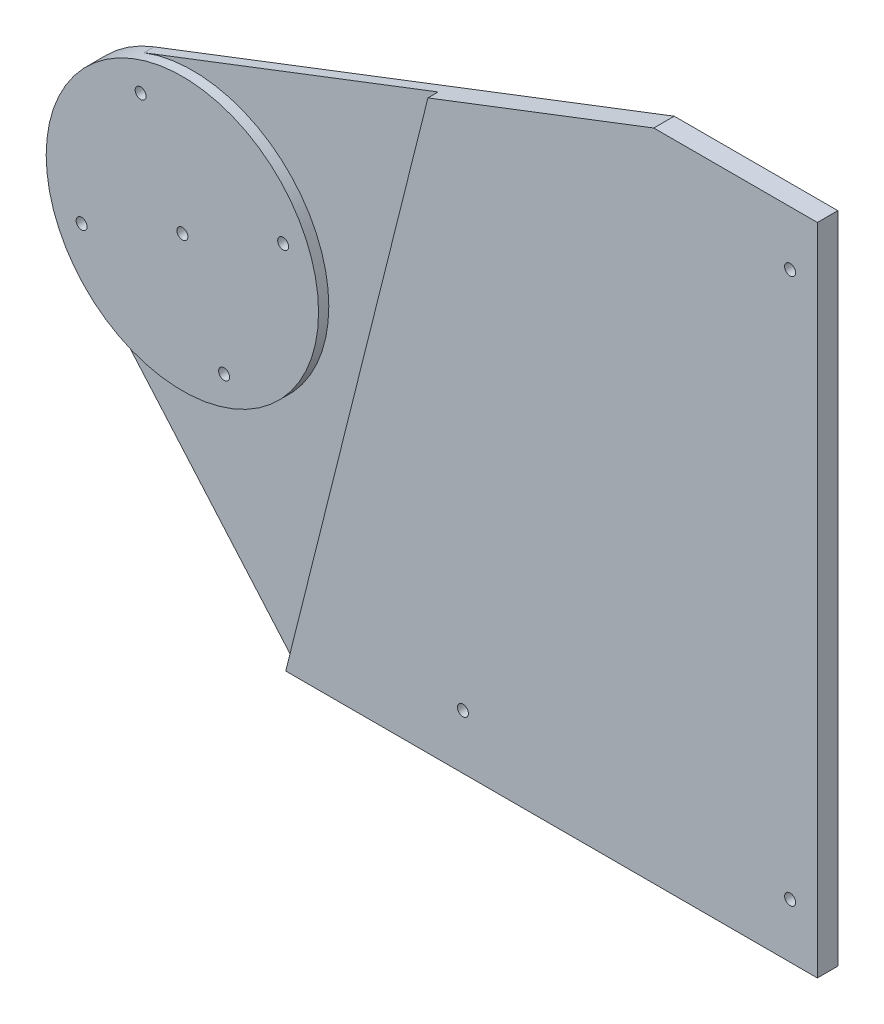
ISO-10303-21;
HEADER;
FILE_DESCRIPTION(('STEP AP214'),'2;1');
FILE_NAME('part.step','',(''),(''),'','','');
FILE_SCHEMA(('AUTOMOTIVE_DESIGN { 1 0 10303 214 1 1 1 1 }'));
ENDSEC;
DATA;
#1=APPLICATION_CONTEXT('core data for automotive mechanical design processes');
#2=APPLICATION_PROTOCOL_DEFINITION('international standard','automotive_design',2000,#1);
#3=PRODUCT_CONTEXT('',#1,'mechanical');
#4=PRODUCT('Part','Part','',(#3));
#5=PRODUCT_RELATED_PRODUCT_CATEGORY('part','',(#4));
#6=PRODUCT_DEFINITION_FORMATION('','',#4);
#7=PRODUCT_DEFINITION_CONTEXT('part definition',#1,'design');
#8=PRODUCT_DEFINITION('design','',#6,#7);
#9=PRODUCT_DEFINITION_SHAPE('','',#8);
#10=(LENGTH_UNIT() NAMED_UNIT(*) SI_UNIT(.MILLI.,.METRE.));
#11=(NAMED_UNIT(*) PLANE_ANGLE_UNIT() SI_UNIT($,.RADIAN.));
#12=(NAMED_UNIT(*) SI_UNIT($,.STERADIAN.) SOLID_ANGLE_UNIT());
#13=UNCERTAINTY_MEASURE_WITH_UNIT(LENGTH_MEASURE(1.E-05),#10,'distance_accuracy_value','');
#14=(GEOMETRIC_REPRESENTATION_CONTEXT(3) GLOBAL_UNCERTAINTY_ASSIGNED_CONTEXT((#13)) GLOBAL_UNIT_ASSIGNED_CONTEXT((#10,
#11,#12)) REPRESENTATION_CONTEXT('',''));
#15=CARTESIAN_POINT('',(0.,0.,0.));
#16=DIRECTION('',(0.,0.,1.));
#17=DIRECTION('',(1.,0.,0.));
#18=AXIS2_PLACEMENT_3D('',#15,#16,#17);
#19=CARTESIAN_POINT('',(-47.9375603293225,-41.5473205143554,-9.525));
#20=DIRECTION('',(0.755677887798388,0.654943455492585,0.));
#21=DIRECTION('',(-0.654943455492585,0.755677887798388,0.));
#22=AXIS2_PLACEMENT_3D('',#19,#20,#21);
#23=PLANE('',#22);
#24=DIRECTION('',(-0.654943455492585,0.755677887798388,0.));
#25=VECTOR('',#24,1.);
#26=CARTESIAN_POINT('',(-47.9375603293225,-41.5473205143554,-4.7752));
#27=LINE('',#26,#25);
#28=CARTESIAN_POINT('',(48.1380800000001,-152.4,-4.7752));
#29=VERTEX_POINT('',#28);
#30=CARTESIAN_POINT('',(-47.9375603293225,-41.5473205143554,-4.7752));
#31=VERTEX_POINT('',#30);
#32=EDGE_CURVE('E200',#29,#31,#27,.T.);
#33=ORIENTED_EDGE('',*,*,#32,.T.);
#34=DIRECTION('',(0.,0.,1.));
#35=VECTOR('',#34,1.);
#36=CARTESIAN_POINT('',(-47.9375603293224,-41.5473205143553,-9.525));
#37=LINE('',#36,#35);
#38=CARTESIAN_POINT('',(-47.9375603293224,-41.5473205143553,-9.525));
#39=VERTEX_POINT('',#38);
#40=EDGE_CURVE('E140',#39,#31,#37,.T.);
#41=ORIENTED_EDGE('',*,*,#40,.F.);
#42=DIRECTION('',(-0.654943455492585,0.755677887798388,0.));
#43=VECTOR('',#42,1.);
#44=CARTESIAN_POINT('',(-47.9375603293225,-41.5473205143554,-9.525));
#45=LINE('',#44,#43);
#46=CARTESIAN_POINT('',(48.1380800000001,-152.4,-9.525));
#47=VERTEX_POINT('',#46);
#48=EDGE_CURVE('E122',#47,#39,#45,.T.);
#49=ORIENTED_EDGE('',*,*,#48,.F.);
#50=DIRECTION('',(0.,0.,1.));
#51=VECTOR('',#50,1.);
#52=CARTESIAN_POINT('',(48.1380800000001,-152.4,-9.525));
#53=LINE('',#52,#51);
#54=EDGE_CURVE('E116',#47,#29,#53,.T.);
#55=ORIENTED_EDGE('',*,*,#54,.T.);
#56=EDGE_LOOP('',(#33,#41,#49,#55));
#57=FACE_BOUND('',#56,.T.);
#58=ADVANCED_FACE('F39',(#57),#23,.F.);
#59=CARTESIAN_POINT('',(0.,0.,0.));
#60=DIRECTION('',(0.,0.,1.));
#61=DIRECTION('',(1.,0.,0.));
#62=AXIS2_PLACEMENT_3D('',#59,#60,#61);
#63=PLANE('',#62);
#64=CARTESIAN_POINT('',(46.9330802515733,19.4403183641468,0.));
#65=DIRECTION('',(0.,0.,1.));
#66=DIRECTION('',(1.,0.,0.));
#67=AXIS2_PLACEMENT_3D('',#64,#65,#66);
#68=CIRCLE('',#67,2.55269999999999);
#69=CARTESIAN_POINT('',(49.4857802515733,19.4403183641468,0.));
#70=VERTEX_POINT('',#69);
#71=EDGE_CURVE('E243',#70,#70,#68,.T.);
#72=ORIENTED_EDGE('',*,*,#71,.F.);
#73=EDGE_LOOP('',(#72));
#74=FACE_BOUND('',#73,.T.);
#75=CARTESIAN_POINT('',(19.4403183641484,-46.9330802515721,0.));
#76=DIRECTION('',(0.,0.,1.));
#77=DIRECTION('',(1.,0.,0.));
#78=AXIS2_PLACEMENT_3D('',#75,#76,#77);
#79=CIRCLE('',#78,2.55269999999999);
#80=CARTESIAN_POINT('',(21.9930183641484,-46.9330802515721,0.));
#81=VERTEX_POINT('',#80);
#82=EDGE_CURVE('E254',#81,#81,#79,.T.);
#83=ORIENTED_EDGE('',*,*,#82,.F.);
#84=EDGE_LOOP('',(#83));
#85=FACE_BOUND('',#84,.T.);
#86=CARTESIAN_POINT('',(-46.9330802515704,-19.4403183641473,0.));
#87=DIRECTION('',(0.,0.,1.));
#88=DIRECTION('',(1.,0.,0.));
#89=AXIS2_PLACEMENT_3D('',#86,#87,#88);
#90=CIRCLE('',#89,2.55269999999998);
#91=CARTESIAN_POINT('',(-44.3803802515704,-19.4403183641473,0.));
#92=VERTEX_POINT('',#91);
#93=EDGE_CURVE('E260',#92,#92,#90,.T.);
#94=ORIENTED_EDGE('',*,*,#93,.F.);
#95=EDGE_LOOP('',(#94));
#96=FACE_BOUND('',#95,.T.);
#97=CARTESIAN_POINT('',(-19.4403183641456,46.9330802515716,0.));
#98=DIRECTION('',(0.,0.,1.));
#99=DIRECTION('',(1.,0.,0.));
#100=AXIS2_PLACEMENT_3D('',#97,#98,#99);
#101=CIRCLE('',#100,2.55269999999999);
#102=CARTESIAN_POINT('',(-16.8876183641456,46.9330802515716,0.));
#103=VERTEX_POINT('',#102);
#104=EDGE_CURVE('E266',#103,#103,#101,.T.);
#105=ORIENTED_EDGE('',*,*,#104,.F.);
#106=EDGE_LOOP('',(#105));
#107=FACE_BOUND('',#106,.T.);
#108=CARTESIAN_POINT('',(1.42594269725294E-12,-2.4980018054066E-13,0.));
#109=DIRECTION('',(0.,0.,1.));
#110=DIRECTION('',(1.,0.,0.));
#111=AXIS2_PLACEMENT_3D('',#108,#109,#110);
#112=CIRCLE('',#111,2.55269999999856);
#113=CARTESIAN_POINT('',(2.55269999999999,-2.4980018054066E-13,0.));
#114=VERTEX_POINT('',#113);
#115=EDGE_CURVE('E271',#114,#114,#112,.T.);
#116=ORIENTED_EDGE('',*,*,#115,.F.);
#117=EDGE_LOOP('',(#116));
#118=FACE_BOUND('',#117,.T.);
#119=CARTESIAN_POINT('',(0.,0.,0.));
#120=DIRECTION('',(0.,0.,1.));
#121=DIRECTION('',(1.,0.,0.));
#122=AXIS2_PLACEMENT_3D('',#119,#120,#121);
#123=CIRCLE('',#122,63.4365);
#124=CARTESIAN_POINT('',(63.4365,0.,0.));
#125=VERTEX_POINT('',#124);
#126=EDGE_CURVE('E130',#125,#125,#123,.T.);
#127=ORIENTED_EDGE('',*,*,#126,.T.);
#128=EDGE_LOOP('',(#127));
#129=FACE_BOUND('',#128,.T.);
#130=ADVANCED_FACE('F180',(#74,#85,#96,#107,#118,#129),#63,.T.);
#131=CARTESIAN_POINT('',(-22.7673240831609,59.2101214856237,-9.525));
#132=DIRECTION('',(0.35889943617887,-0.933376234275594,0.));
#133=DIRECTION('',(0.933376234275594,0.35889943617887,0.));
#134=AXIS2_PLACEMENT_3D('',#131,#132,#133);
#135=PLANE('',#134);
#136=DIRECTION('',(0.933376234275594,0.35889943617887,0.));
#137=VECTOR('',#136,1.);
#138=CARTESIAN_POINT('',(-22.7673240831609,59.2101214856237,-4.7752));
#139=LINE('',#138,#137);
#140=CARTESIAN_POINT('',(-22.7673240831609,59.2101214856237,-4.7752));
#141=VERTEX_POINT('',#140);
#142=CARTESIAN_POINT('',(114.391061614432,111.949912243501,-4.7752));
#143=VERTEX_POINT('',#142);
#144=EDGE_CURVE('E147',#141,#143,#139,.T.);
#145=ORIENTED_EDGE('',*,*,#144,.T.);
#146=DIRECTION('',(0.,0.,1.));
#147=VECTOR('',#146,1.);
#148=CARTESIAN_POINT('',(114.391061614432,111.949912243501,-4.7752));
#149=LINE('',#148,#147);
#150=CARTESIAN_POINT('',(114.391061614432,111.949912243501,0.));
#151=VERTEX_POINT('',#150);
#152=EDGE_CURVE('E131',#143,#151,#149,.T.);
#153=ORIENTED_EDGE('',*,*,#152,.T.);
#154=DIRECTION('',(0.933376234275594,0.35889943617887,0.));
#155=VECTOR('',#154,1.);
#156=CARTESIAN_POINT('',(-22.7673240831609,59.2101214856237,0.));
#157=LINE('',#156,#155);
#158=CARTESIAN_POINT('',(219.58808,152.4,0.));
#159=VERTEX_POINT('',#158);
#160=EDGE_CURVE('E80',#151,#159,#157,.T.);
#161=ORIENTED_EDGE('',*,*,#160,.T.);
#162=DIRECTION('',(0.,0.,1.));
#163=VECTOR('',#162,1.);
#164=CARTESIAN_POINT('',(219.58808,152.4,-9.525));
#165=LINE('',#164,#163);
#166=CARTESIAN_POINT('',(219.58808,152.4,-9.525));
#167=VERTEX_POINT('',#166);
#168=EDGE_CURVE('E11',#167,#159,#165,.T.);
#169=ORIENTED_EDGE('',*,*,#168,.F.);
#170=DIRECTION('',(0.933376234275594,0.35889943617887,0.));
#171=VECTOR('',#170,1.);
#172=CARTESIAN_POINT('',(-22.7673240831609,59.2101214856237,-9.525));
#173=LINE('',#172,#171);
#174=CARTESIAN_POINT('',(-22.7673240831609,59.2101214856237,-9.525));
#175=VERTEX_POINT('',#174);
#176=EDGE_CURVE('E137',#175,#167,#173,.T.);
#177=ORIENTED_EDGE('',*,*,#176,.F.);
#178=DIRECTION('',(0.,0.,1.));
#179=VECTOR('',#178,1.);
#180=CARTESIAN_POINT('',(-22.7673240831609,59.2101214856237,-9.525));
#181=LINE('',#180,#179);
#182=EDGE_CURVE('E43',#175,#141,#181,.T.);
#183=ORIENTED_EDGE('',*,*,#182,.T.);
#184=EDGE_LOOP('',(#145,#153,#161,#169,#177,#183));
#185=FACE_BOUND('',#184,.T.);
#186=ADVANCED_FACE('F41',(#185),#135,.F.);
#187=CARTESIAN_POINT('',(0.,152.4,-9.525));
#188=DIRECTION('',(0.,-1.,0.));
#189=DIRECTION('',(1.,0.,0.));
#190=AXIS2_PLACEMENT_3D('',#187,#188,#189);
#191=PLANE('',#190);
#192=DIRECTION('',(1.,0.,0.));
#193=VECTOR('',#192,1.);
#194=CARTESIAN_POINT('',(0.,152.4,0.));
#195=LINE('',#194,#193);
#196=CARTESIAN_POINT('',(295.78808,152.4,0.));
#197=VERTEX_POINT('',#196);
#198=EDGE_CURVE('E72',#159,#197,#195,.T.);
#199=ORIENTED_EDGE('',*,*,#198,.T.);
#200=DIRECTION('',(0.,0.,1.));
#201=VECTOR('',#200,1.);
#202=CARTESIAN_POINT('',(295.78808,152.4,-9.525));
#203=LINE('',#202,#201);
#204=CARTESIAN_POINT('',(295.78808,152.4,-9.525));
#205=VERTEX_POINT('',#204);
#206=EDGE_CURVE('E49',#205,#197,#203,.T.);
#207=ORIENTED_EDGE('',*,*,#206,.F.);
#208=DIRECTION('',(1.,0.,0.));
#209=VECTOR('',#208,1.);
#210=CARTESIAN_POINT('',(0.,152.4,-9.525));
#211=LINE('',#210,#209);
#212=EDGE_CURVE('E57',#167,#205,#211,.T.);
#213=ORIENTED_EDGE('',*,*,#212,.F.);
#214=ORIENTED_EDGE('',*,*,#168,.T.);
#215=EDGE_LOOP('',(#199,#207,#213,#214));
#216=FACE_BOUND('',#215,.T.);
#217=ADVANCED_FACE('F172',(#216),#191,.F.);
#218=CARTESIAN_POINT('',(295.78808,1.07739743053041E-13,-9.525));
#219=DIRECTION('',(-1.,0.,0.));
#220=DIRECTION('',(0.,-1.,0.));
#221=AXIS2_PLACEMENT_3D('',#218,#219,#220);
#222=PLANE('',#221);
#223=DIRECTION('',(0.,-1.,0.));
#224=VECTOR('',#223,1.);
#225=CARTESIAN_POINT('',(295.78808,1.07739743053041E-13,0.));
#226=LINE('',#225,#224);
#227=CARTESIAN_POINT('',(295.78808,-152.4,0.));
#228=VERTEX_POINT('',#227);
#229=EDGE_CURVE('E112',#197,#228,#226,.T.);
#230=ORIENTED_EDGE('',*,*,#229,.T.);
#231=DIRECTION('',(0.,0.,1.));
#232=VECTOR('',#231,1.);
#233=CARTESIAN_POINT('',(295.78808,-152.4,-9.525));
#234=LINE('',#233,#232);
#235=CARTESIAN_POINT('',(295.78808,-152.4,-9.525));
#236=VERTEX_POINT('',#235);
#237=EDGE_CURVE('E109',#236,#228,#234,.T.);
#238=ORIENTED_EDGE('',*,*,#237,.F.);
#239=DIRECTION('',(0.,-1.,0.));
#240=VECTOR('',#239,1.);
#241=CARTESIAN_POINT('',(295.78808,1.07739743053041E-13,-9.525));
#242=LINE('',#241,#240);
#243=EDGE_CURVE('E100',#205,#236,#242,.T.);
#244=ORIENTED_EDGE('',*,*,#243,.F.);
#245=ORIENTED_EDGE('',*,*,#206,.T.);
#246=EDGE_LOOP('',(#230,#238,#244,#245));
#247=FACE_BOUND('',#246,.T.);
#248=ADVANCED_FACE('F110',(#247),#222,.F.);
#249=CARTESIAN_POINT('',(0.,-152.4,-9.525));
#250=DIRECTION('',(0.,1.,0.));
#251=DIRECTION('',(-1.,0.,0.));
#252=AXIS2_PLACEMENT_3D('',#249,#250,#251);
#253=PLANE('',#252);
#254=DIRECTION('',(-1.,0.,0.));
#255=VECTOR('',#254,1.);
#256=CARTESIAN_POINT('',(0.,-152.4,0.));
#257=LINE('',#256,#255);
#258=CARTESIAN_POINT('',(48.1380800000001,-152.4,0.));
#259=VERTEX_POINT('',#258);
#260=EDGE_CURVE('E134',#228,#259,#257,.T.);
#261=ORIENTED_EDGE('',*,*,#260,.T.);
#262=DIRECTION('',(0.,0.,1.));
#263=VECTOR('',#262,1.);
#264=CARTESIAN_POINT('',(48.1380800000001,-152.4,-4.7752));
#265=LINE('',#264,#263);
#266=EDGE_CURVE('E166',#29,#259,#265,.T.);
#267=ORIENTED_EDGE('',*,*,#266,.F.);
#268=ORIENTED_EDGE('',*,*,#54,.F.);
#269=DIRECTION('',(-1.,0.,0.));
#270=VECTOR('',#269,1.);
#271=CARTESIAN_POINT('',(0.,-152.4,-9.525));
#272=LINE('',#271,#270);
#273=EDGE_CURVE('E104',#236,#47,#272,.T.);
#274=ORIENTED_EDGE('',*,*,#273,.F.);
#275=ORIENTED_EDGE('',*,*,#237,.T.);
#276=EDGE_LOOP('',(#261,#267,#268,#274,#275));
#277=FACE_BOUND('',#276,.T.);
#278=ADVANCED_FACE('F118',(#277),#253,.F.);
#279=CARTESIAN_POINT('',(0.,0.,-9.525));
#280=DIRECTION('',(0.,0.,1.));
#281=DIRECTION('',(1.,0.,0.));
#282=AXIS2_PLACEMENT_3D('',#279,#280,#281);
#283=CYLINDRICAL_SURFACE('',#282,63.4365);
#284=ORIENTED_EDGE('',*,*,#126,.F.);
#285=EDGE_LOOP('',(#284));
#286=FACE_BOUND('',#285,.T.);
#287=CARTESIAN_POINT('',(0.,0.,-4.7752));
#288=DIRECTION('',(0.,0.,1.));
#289=DIRECTION('',(1.,0.,0.));
#290=AXIS2_PLACEMENT_3D('',#287,#288,#289);
#291=CIRCLE('',#290,63.4365);
#292=EDGE_CURVE('E158',#31,#141,#291,.T.);
#293=ORIENTED_EDGE('',*,*,#292,.T.);
#294=ORIENTED_EDGE('',*,*,#182,.F.);
#295=CARTESIAN_POINT('',(0.,0.,-9.525));
#296=DIRECTION('',(0.,0.,1.));
#297=DIRECTION('',(1.,0.,0.));
#298=AXIS2_PLACEMENT_3D('',#295,#296,#297);
#299=CIRCLE('',#298,63.4365);
#300=EDGE_CURVE('E124',#175,#39,#299,.T.);
#301=ORIENTED_EDGE('',*,*,#300,.T.);
#302=ORIENTED_EDGE('',*,*,#40,.T.);
#303=EDGE_LOOP('',(#293,#294,#301,#302));
#304=FACE_BOUND('',#303,.T.);
#305=ADVANCED_FACE('F190',(#286,#304),#283,.T.);
#306=CARTESIAN_POINT('',(0.,0.,-9.525));
#307=DIRECTION('',(0.,0.,1.));
#308=DIRECTION('',(1.,0.,0.));
#309=AXIS2_PLACEMENT_3D('',#306,#307,#308);
#310=PLANE('',#309);
#311=CARTESIAN_POINT('',(283.08808,127.,-9.525));
#312=DIRECTION('',(0.,0.,1.));
#313=DIRECTION('',(1.,0.,0.));
#314=AXIS2_PLACEMENT_3D('',#311,#312,#313);
#315=CIRCLE('',#314,2.55270000000002);
#316=CARTESIAN_POINT('',(285.64078,127.,-9.525));
#317=VERTEX_POINT('',#316);
#318=EDGE_CURVE('E318',#317,#317,#315,.T.);
#319=ORIENTED_EDGE('',*,*,#318,.T.);
#320=EDGE_LOOP('',(#319));
#321=FACE_BOUND('',#320,.T.);
#322=CARTESIAN_POINT('',(283.08808,-127.,-9.525));
#323=DIRECTION('',(0.,0.,1.));
#324=DIRECTION('',(1.,0.,0.));
#325=AXIS2_PLACEMENT_3D('',#322,#323,#324);
#326=CIRCLE('',#325,2.55270000000002);
#327=CARTESIAN_POINT('',(285.64078,-127.,-9.525));
#328=VERTEX_POINT('',#327);
#329=EDGE_CURVE('E240',#328,#328,#326,.T.);
#330=ORIENTED_EDGE('',*,*,#329,.T.);
#331=EDGE_LOOP('',(#330));
#332=FACE_BOUND('',#331,.T.);
#333=CARTESIAN_POINT('',(130.68808,-127.,-9.525));
#334=DIRECTION('',(0.,0.,1.));
#335=DIRECTION('',(1.,0.,0.));
#336=AXIS2_PLACEMENT_3D('',#333,#334,#335);
#337=CIRCLE('',#336,2.55269999999999);
#338=CARTESIAN_POINT('',(133.24078,-127.,-9.525));
#339=VERTEX_POINT('',#338);
#340=EDGE_CURVE('E239',#339,#339,#337,.T.);
#341=ORIENTED_EDGE('',*,*,#340,.T.);
#342=EDGE_LOOP('',(#341));
#343=FACE_BOUND('',#342,.T.);
#344=CARTESIAN_POINT('',(46.9330802515733,19.4403183641468,-9.525));
#345=DIRECTION('',(0.,0.,1.));
#346=DIRECTION('',(1.,0.,0.));
#347=AXIS2_PLACEMENT_3D('',#344,#345,#346);
#348=CIRCLE('',#347,2.5527);
#349=CARTESIAN_POINT('',(49.4857802515733,19.4403183641468,-9.525));
#350=VERTEX_POINT('',#349);
#351=EDGE_CURVE('E251',#350,#350,#348,.T.);
#352=ORIENTED_EDGE('',*,*,#351,.T.);
#353=EDGE_LOOP('',(#352));
#354=FACE_BOUND('',#353,.T.);
#355=CARTESIAN_POINT('',(19.4403183641484,-46.9330802515721,-9.525));
#356=DIRECTION('',(0.,0.,1.));
#357=DIRECTION('',(1.,0.,0.));
#358=AXIS2_PLACEMENT_3D('',#355,#356,#357);
#359=CIRCLE('',#358,2.5527);
#360=CARTESIAN_POINT('',(21.9930183641484,-46.9330802515721,-9.525));
#361=VERTEX_POINT('',#360);
#362=EDGE_CURVE('E257',#361,#361,#359,.T.);
#363=ORIENTED_EDGE('',*,*,#362,.T.);
#364=EDGE_LOOP('',(#363));
#365=FACE_BOUND('',#364,.T.);
#366=CARTESIAN_POINT('',(-46.9330802515704,-19.4403183641473,-9.525));
#367=DIRECTION('',(0.,0.,1.));
#368=DIRECTION('',(1.,0.,0.));
#369=AXIS2_PLACEMENT_3D('',#366,#367,#368);
#370=CIRCLE('',#369,2.5527);
#371=CARTESIAN_POINT('',(-44.3803802515704,-19.4403183641473,-9.525));
#372=VERTEX_POINT('',#371);
#373=EDGE_CURVE('E263',#372,#372,#370,.T.);
#374=ORIENTED_EDGE('',*,*,#373,.T.);
#375=EDGE_LOOP('',(#374));
#376=FACE_BOUND('',#375,.T.);
#377=CARTESIAN_POINT('',(-19.4403183641456,46.9330802515716,-9.525));
#378=DIRECTION('',(0.,0.,1.));
#379=DIRECTION('',(1.,0.,0.));
#380=AXIS2_PLACEMENT_3D('',#377,#378,#379);
#381=CIRCLE('',#380,2.5527);
#382=CARTESIAN_POINT('',(-16.8876183641456,46.9330802515716,-9.525));
#383=VERTEX_POINT('',#382);
#384=EDGE_CURVE('E269',#383,#383,#381,.T.);
#385=ORIENTED_EDGE('',*,*,#384,.T.);
#386=EDGE_LOOP('',(#385));
#387=FACE_BOUND('',#386,.T.);
#388=CARTESIAN_POINT('',(1.42594269725294E-12,-2.4980018054066E-13,-9.525));
#389=DIRECTION('',(0.,0.,1.));
#390=DIRECTION('',(1.,0.,0.));
#391=AXIS2_PLACEMENT_3D('',#388,#389,#390);
#392=CIRCLE('',#391,2.55269999999857);
#393=CARTESIAN_POINT('',(2.5527,-2.4980018054066E-13,-9.525));
#394=VERTEX_POINT('',#393);
#395=EDGE_CURVE('E168',#394,#394,#392,.T.);
#396=ORIENTED_EDGE('',*,*,#395,.T.);
#397=EDGE_LOOP('',(#396));
#398=FACE_BOUND('',#397,.T.);
#399=ORIENTED_EDGE('',*,*,#176,.T.);
#400=ORIENTED_EDGE('',*,*,#212,.T.);
#401=ORIENTED_EDGE('',*,*,#243,.T.);
#402=ORIENTED_EDGE('',*,*,#273,.T.);
#403=ORIENTED_EDGE('',*,*,#48,.T.);
#404=ORIENTED_EDGE('',*,*,#300,.F.);
#405=EDGE_LOOP('',(#399,#400,#401,#402,#403,#404));
#406=FACE_BOUND('',#405,.T.);
#407=ADVANCED_FACE('F102',(#321,#332,#343,#354,#365,#376,#387,#398,#406),#310,.F.);
#408=CARTESIAN_POINT('',(283.08808,127.,0.));
#409=DIRECTION('',(0.,0.,1.));
#410=DIRECTION('',(1.,0.,0.));
#411=AXIS2_PLACEMENT_3D('',#408,#409,#410);
#412=CIRCLE('',#411,2.55269999999996);
#413=CARTESIAN_POINT('',(285.64078,127.,0.));
#414=VERTEX_POINT('',#413);
#415=EDGE_CURVE('E230',#414,#414,#412,.T.);
#416=ORIENTED_EDGE('',*,*,#415,.F.);
#417=EDGE_LOOP('',(#416));
#418=FACE_BOUND('',#417,.T.);
#419=CARTESIAN_POINT('',(283.08808,-127.,0.));
#420=DIRECTION('',(0.,0.,1.));
#421=DIRECTION('',(1.,0.,0.));
#422=AXIS2_PLACEMENT_3D('',#419,#420,#421);
#423=CIRCLE('',#422,2.55269999999996);
#424=CARTESIAN_POINT('',(285.64078,-127.,0.));
#425=VERTEX_POINT('',#424);
#426=EDGE_CURVE('E234',#425,#425,#423,.T.);
#427=ORIENTED_EDGE('',*,*,#426,.F.);
#428=EDGE_LOOP('',(#427));
#429=FACE_BOUND('',#428,.T.);
#430=CARTESIAN_POINT('',(130.68808,-127.,0.));
#431=DIRECTION('',(0.,0.,1.));
#432=DIRECTION('',(1.,0.,0.));
#433=AXIS2_PLACEMENT_3D('',#430,#431,#432);
#434=CIRCLE('',#433,2.55269999999999);
#435=CARTESIAN_POINT('',(133.24078,-127.,0.));
#436=VERTEX_POINT('',#435);
#437=EDGE_CURVE('E237',#436,#436,#434,.T.);
#438=ORIENTED_EDGE('',*,*,#437,.F.);
#439=EDGE_LOOP('',(#438));
#440=FACE_BOUND('',#439,.T.);
#441=DIRECTION('',(0.243107154615321,0.969999438852849,0.));
#442=VECTOR('',#441,1.);
#443=CARTESIAN_POINT('',(81.2310907299105,-20.3586296472521,0.));
#444=LINE('',#443,#442);
#445=EDGE_CURVE('E163',#259,#151,#444,.T.);
#446=ORIENTED_EDGE('',*,*,#445,.F.);
#447=ORIENTED_EDGE('',*,*,#260,.F.);
#448=ORIENTED_EDGE('',*,*,#229,.F.);
#449=ORIENTED_EDGE('',*,*,#198,.F.);
#450=ORIENTED_EDGE('',*,*,#160,.F.);
#451=EDGE_LOOP('',(#446,#447,#448,#449,#450));
#452=FACE_BOUND('',#451,.T.);
#453=ADVANCED_FACE('F171',(#418,#429,#440,#452),#63,.T.);
#454=CARTESIAN_POINT('',(81.2310907299105,-20.3586296472521,-4.7752));
#455=DIRECTION('',(0.969999438852849,-0.243107154615321,0.));
#456=DIRECTION('',(0.243107154615321,0.969999438852849,0.));
#457=AXIS2_PLACEMENT_3D('',#454,#455,#456);
#458=PLANE('',#457);
#459=ORIENTED_EDGE('',*,*,#445,.T.);
#460=ORIENTED_EDGE('',*,*,#152,.F.);
#461=DIRECTION('',(0.243107154615321,0.969999438852849,0.));
#462=VECTOR('',#461,1.);
#463=CARTESIAN_POINT('',(81.2310907299105,-20.3586296472521,-4.7752));
#464=LINE('',#463,#462);
#465=EDGE_CURVE('E202',#29,#143,#464,.T.);
#466=ORIENTED_EDGE('',*,*,#465,.F.);
#467=ORIENTED_EDGE('',*,*,#266,.T.);
#468=EDGE_LOOP('',(#459,#460,#466,#467));
#469=FACE_BOUND('',#468,.T.);
#470=ADVANCED_FACE('F164',(#469),#458,.F.);
#471=CARTESIAN_POINT('',(0.,0.,-4.7752));
#472=DIRECTION('',(0.,0.,1.));
#473=DIRECTION('',(1.,0.,0.));
#474=AXIS2_PLACEMENT_3D('',#471,#472,#473);
#475=PLANE('',#474);
#476=ORIENTED_EDGE('',*,*,#292,.F.);
#477=ORIENTED_EDGE('',*,*,#32,.F.);
#478=ORIENTED_EDGE('',*,*,#465,.T.);
#479=ORIENTED_EDGE('',*,*,#144,.F.);
#480=EDGE_LOOP('',(#476,#477,#478,#479));
#481=FACE_BOUND('',#480,.T.);
#482=ADVANCED_FACE('F210',(#481),#475,.T.);
#483=CARTESIAN_POINT('',(1.42594269725294E-12,-2.4980018054066E-13,0.));
#484=DIRECTION('',(0.,0.,1.));
#485=DIRECTION('',(1.,0.,0.));
#486=AXIS2_PLACEMENT_3D('',#483,#484,#485);
#487=CYLINDRICAL_SURFACE('',#486,2.55269999999857);
#488=ORIENTED_EDGE('',*,*,#395,.F.);
#489=EDGE_LOOP('',(#488));
#490=FACE_BOUND('',#489,.T.);
#491=ORIENTED_EDGE('',*,*,#115,.T.);
#492=EDGE_LOOP('',(#491));
#493=FACE_BOUND('',#492,.T.);
#494=ADVANCED_FACE('F212',(#490,#493),#487,.F.);
#495=CARTESIAN_POINT('',(-19.4403183641456,46.9330802515716,0.));
#496=DIRECTION('',(0.,0.,1.));
#497=DIRECTION('',(1.,0.,0.));
#498=AXIS2_PLACEMENT_3D('',#495,#496,#497);
#499=CYLINDRICAL_SURFACE('',#498,2.55269999999999);
#500=ORIENTED_EDGE('',*,*,#384,.F.);
#501=EDGE_LOOP('',(#500));
#502=FACE_BOUND('',#501,.T.);
#503=ORIENTED_EDGE('',*,*,#104,.T.);
#504=EDGE_LOOP('',(#503));
#505=FACE_BOUND('',#504,.T.);
#506=ADVANCED_FACE('F218',(#502,#505),#499,.F.);
#507=CARTESIAN_POINT('',(-46.9330802515704,-19.4403183641473,0.));
#508=DIRECTION('',(0.,0.,1.));
#509=DIRECTION('',(1.,0.,0.));
#510=AXIS2_PLACEMENT_3D('',#507,#508,#509);
#511=CYLINDRICAL_SURFACE('',#510,2.55269999999999);
#512=ORIENTED_EDGE('',*,*,#373,.F.);
#513=EDGE_LOOP('',(#512));
#514=FACE_BOUND('',#513,.T.);
#515=ORIENTED_EDGE('',*,*,#93,.T.);
#516=EDGE_LOOP('',(#515));
#517=FACE_BOUND('',#516,.T.);
#518=ADVANCED_FACE('F285',(#514,#517),#511,.F.);
#519=CARTESIAN_POINT('',(19.4403183641484,-46.9330802515721,0.));
#520=DIRECTION('',(0.,0.,1.));
#521=DIRECTION('',(1.,0.,0.));
#522=AXIS2_PLACEMENT_3D('',#519,#520,#521);
#523=CYLINDRICAL_SURFACE('',#522,2.55269999999999);
#524=ORIENTED_EDGE('',*,*,#362,.F.);
#525=EDGE_LOOP('',(#524));
#526=FACE_BOUND('',#525,.T.);
#527=ORIENTED_EDGE('',*,*,#82,.T.);
#528=EDGE_LOOP('',(#527));
#529=FACE_BOUND('',#528,.T.);
#530=ADVANCED_FACE('F291',(#526,#529),#523,.F.);
#531=CARTESIAN_POINT('',(46.9330802515733,19.4403183641468,0.));
#532=DIRECTION('',(0.,0.,1.));
#533=DIRECTION('',(1.,0.,0.));
#534=AXIS2_PLACEMENT_3D('',#531,#532,#533);
#535=CYLINDRICAL_SURFACE('',#534,2.55269999999999);
#536=ORIENTED_EDGE('',*,*,#351,.F.);
#537=EDGE_LOOP('',(#536));
#538=FACE_BOUND('',#537,.T.);
#539=ORIENTED_EDGE('',*,*,#71,.T.);
#540=EDGE_LOOP('',(#539));
#541=FACE_BOUND('',#540,.T.);
#542=ADVANCED_FACE('F297',(#538,#541),#535,.F.);
#543=CARTESIAN_POINT('',(130.68808,-127.,0.));
#544=DIRECTION('',(0.,0.,1.));
#545=DIRECTION('',(1.,0.,0.));
#546=AXIS2_PLACEMENT_3D('',#543,#544,#545);
#547=CYLINDRICAL_SURFACE('',#546,2.55269999999999);
#548=ORIENTED_EDGE('',*,*,#340,.F.);
#549=EDGE_LOOP('',(#548));
#550=FACE_BOUND('',#549,.T.);
#551=ORIENTED_EDGE('',*,*,#437,.T.);
#552=EDGE_LOOP('',(#551));
#553=FACE_BOUND('',#552,.T.);
#554=ADVANCED_FACE('F301',(#550,#553),#547,.F.);
#555=CARTESIAN_POINT('',(283.08808,-127.,0.));
#556=DIRECTION('',(0.,0.,1.));
#557=DIRECTION('',(1.,0.,0.));
#558=AXIS2_PLACEMENT_3D('',#555,#556,#557);
#559=CYLINDRICAL_SURFACE('',#558,2.55269999999999);
#560=ORIENTED_EDGE('',*,*,#329,.F.);
#561=EDGE_LOOP('',(#560));
#562=FACE_BOUND('',#561,.T.);
#563=ORIENTED_EDGE('',*,*,#426,.T.);
#564=EDGE_LOOP('',(#563));
#565=FACE_BOUND('',#564,.T.);
#566=ADVANCED_FACE('F305',(#562,#565),#559,.F.);
#567=CARTESIAN_POINT('',(283.08808,127.,0.));
#568=DIRECTION('',(0.,0.,1.));
#569=DIRECTION('',(1.,0.,0.));
#570=AXIS2_PLACEMENT_3D('',#567,#568,#569);
#571=CYLINDRICAL_SURFACE('',#570,2.55269999999999);
#572=ORIENTED_EDGE('',*,*,#318,.F.);
#573=EDGE_LOOP('',(#572));
#574=FACE_BOUND('',#573,.T.);
#575=ORIENTED_EDGE('',*,*,#415,.T.);
#576=EDGE_LOOP('',(#575));
#577=FACE_BOUND('',#576,.T.);
#578=ADVANCED_FACE('F309',(#574,#577),#571,.F.);
#579=CLOSED_SHELL('',(#58,#130,#186,#217,#248,#278,#305,#407,#453,#470,#482,#494,#506,#518,#530,
#542,#554,#566,#578));
#580=MANIFOLD_SOLID_BREP('B2',#579);
#581=ADVANCED_BREP_SHAPE_REPRESENTATION('',(#18,#580),#14);
#582=SHAPE_DEFINITION_REPRESENTATION(#9,#581);
ENDSEC;
END-ISO-10303-21;
